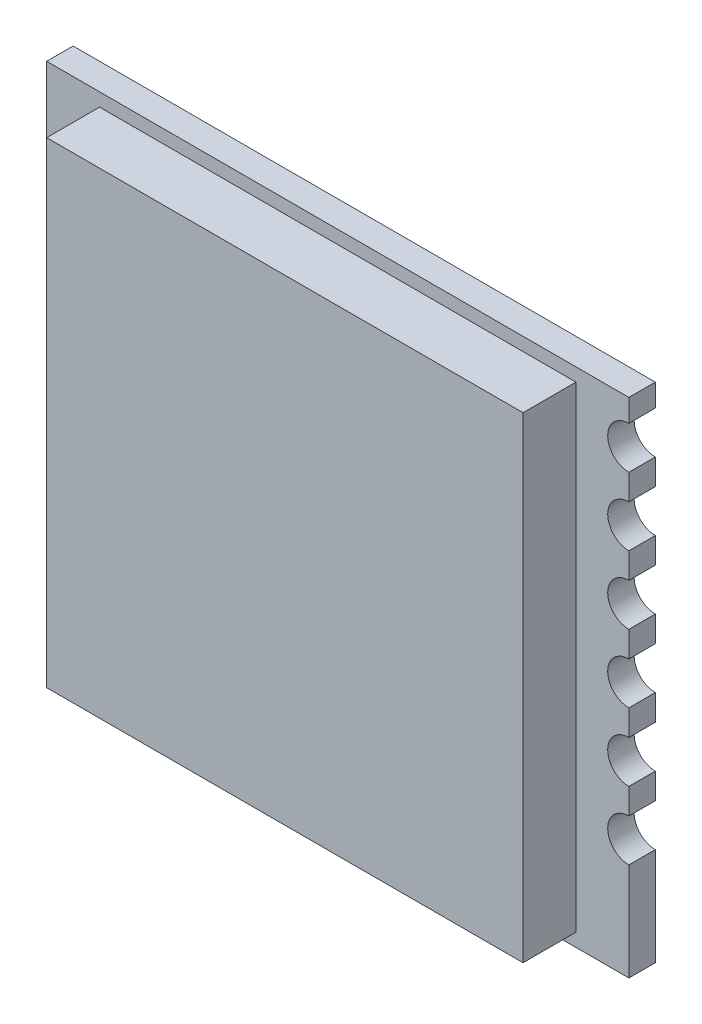
ISO-10303-21;
HEADER;
FILE_DESCRIPTION(('STEP AP214'),'2;1');
FILE_NAME('part.step','',(''),(''),'','','');
FILE_SCHEMA(('AUTOMOTIVE_DESIGN { 1 0 10303 214 1 1 1 1 }'));
ENDSEC;
DATA;
#1=APPLICATION_CONTEXT('core data for automotive mechanical design processes');
#2=APPLICATION_PROTOCOL_DEFINITION('international standard','automotive_design',2000,#1);
#3=PRODUCT_CONTEXT('',#1,'mechanical');
#4=PRODUCT('Part','Part','',(#3));
#5=PRODUCT_RELATED_PRODUCT_CATEGORY('part','',(#4));
#6=PRODUCT_DEFINITION_FORMATION('','',#4);
#7=PRODUCT_DEFINITION_CONTEXT('part definition',#1,'design');
#8=PRODUCT_DEFINITION('design','',#6,#7);
#9=PRODUCT_DEFINITION_SHAPE('','',#8);
#10=(LENGTH_UNIT() NAMED_UNIT(*) SI_UNIT(.MILLI.,.METRE.));
#11=(NAMED_UNIT(*) PLANE_ANGLE_UNIT() SI_UNIT($,.RADIAN.));
#12=(NAMED_UNIT(*) SI_UNIT($,.STERADIAN.) SOLID_ANGLE_UNIT());
#13=UNCERTAINTY_MEASURE_WITH_UNIT(LENGTH_MEASURE(1.E-05),#10,'distance_accuracy_value','');
#14=(GEOMETRIC_REPRESENTATION_CONTEXT(3) GLOBAL_UNCERTAINTY_ASSIGNED_CONTEXT((#13)) GLOBAL_UNIT_ASSIGNED_CONTEXT((#10,
#11,#12)) REPRESENTATION_CONTEXT('',''));
#15=CARTESIAN_POINT('',(0.,0.,0.));
#16=DIRECTION('',(0.,0.,1.));
#17=DIRECTION('',(1.,0.,0.));
#18=AXIS2_PLACEMENT_3D('',#15,#16,#17);
#19=CARTESIAN_POINT('',(-11.,-9.5,1.));
#20=DIRECTION('',(1.,0.,0.));
#21=DIRECTION('',(0.,1.,0.));
#22=AXIS2_PLACEMENT_3D('',#19,#20,#21);
#23=PLANE('',#22);
#24=DIRECTION('',(0.,-1.,0.));
#25=VECTOR('',#24,1.);
#26=CARTESIAN_POINT('',(-11.,-9.5,0.));
#27=LINE('',#26,#25);
#28=CARTESIAN_POINT('',(-11.,9.5,0.));
#29=VERTEX_POINT('',#28);
#30=CARTESIAN_POINT('',(-11.,6.08,0.));
#31=VERTEX_POINT('',#30);
#32=EDGE_CURVE('E403',#29,#31,#27,.T.);
#33=ORIENTED_EDGE('',*,*,#32,.T.);
#34=DIRECTION('',(0.,0.,1.));
#35=VECTOR('',#34,1.);
#36=CARTESIAN_POINT('',(-11.,6.08,0.));
#37=LINE('',#36,#35);
#38=CARTESIAN_POINT('',(-11.,6.08,1.));
#39=VERTEX_POINT('',#38);
#40=EDGE_CURVE('E554',#31,#39,#37,.T.);
#41=ORIENTED_EDGE('',*,*,#40,.T.);
#42=DIRECTION('',(0.,-1.,0.));
#43=VECTOR('',#42,1.);
#44=CARTESIAN_POINT('',(-11.,-9.5,1.));
#45=LINE('',#44,#43);
#46=CARTESIAN_POINT('',(-11.,9.5,1.));
#47=VERTEX_POINT('',#46);
#48=EDGE_CURVE('E394',#47,#39,#45,.T.);
#49=ORIENTED_EDGE('',*,*,#48,.F.);
#50=DIRECTION('',(0.,0.,-1.));
#51=VECTOR('',#50,1.);
#52=CARTESIAN_POINT('',(-11.,9.5,1.));
#53=LINE('',#52,#51);
#54=EDGE_CURVE('E270',#47,#29,#53,.T.);
#55=ORIENTED_EDGE('',*,*,#54,.T.);
#56=EDGE_LOOP('',(#33,#41,#49,#55));
#57=FACE_BOUND('',#56,.T.);
#58=ADVANCED_FACE('F38',(#57),#23,.F.);
#59=CARTESIAN_POINT('',(-11.,4.48,1.));
#60=VERTEX_POINT('',#59);
#61=CARTESIAN_POINT('',(-11.,3.51,1.));
#62=VERTEX_POINT('',#61);
#63=EDGE_CURVE('E398',#60,#62,#45,.T.);
#64=ORIENTED_EDGE('',*,*,#63,.F.);
#65=DIRECTION('',(0.,0.,1.));
#66=VECTOR('',#65,1.);
#67=CARTESIAN_POINT('',(-11.,4.48,0.));
#68=LINE('',#67,#66);
#69=CARTESIAN_POINT('',(-11.,4.48,0.));
#70=VERTEX_POINT('',#69);
#71=EDGE_CURVE('E327',#70,#60,#68,.T.);
#72=ORIENTED_EDGE('',*,*,#71,.F.);
#73=CARTESIAN_POINT('',(-11.,3.51,0.));
#74=VERTEX_POINT('',#73);
#75=EDGE_CURVE('E405',#70,#74,#27,.T.);
#76=ORIENTED_EDGE('',*,*,#75,.T.);
#77=DIRECTION('',(0.,0.,1.));
#78=VECTOR('',#77,1.);
#79=CARTESIAN_POINT('',(-11.,3.51,0.));
#80=LINE('',#79,#78);
#81=EDGE_CURVE('E326',#74,#62,#80,.T.);
#82=ORIENTED_EDGE('',*,*,#81,.T.);
#83=EDGE_LOOP('',(#64,#72,#76,#82));
#84=FACE_BOUND('',#83,.T.);
#85=ADVANCED_FACE('F460',(#84),#23,.F.);
#86=CARTESIAN_POINT('',(-11.,1.91,1.));
#87=VERTEX_POINT('',#86);
#88=CARTESIAN_POINT('',(-11.,0.939999999999998,1.));
#89=VERTEX_POINT('',#88);
#90=EDGE_CURVE('E440',#87,#89,#45,.T.);
#91=ORIENTED_EDGE('',*,*,#90,.F.);
#92=DIRECTION('',(0.,0.,1.));
#93=VECTOR('',#92,1.);
#94=CARTESIAN_POINT('',(-11.,1.91,0.));
#95=LINE('',#94,#93);
#96=CARTESIAN_POINT('',(-11.,1.91,0.));
#97=VERTEX_POINT('',#96);
#98=EDGE_CURVE('E319',#97,#87,#95,.T.);
#99=ORIENTED_EDGE('',*,*,#98,.F.);
#100=CARTESIAN_POINT('',(-11.,0.939999999999998,0.));
#101=VERTEX_POINT('',#100);
#102=EDGE_CURVE('E410',#97,#101,#27,.T.);
#103=ORIENTED_EDGE('',*,*,#102,.T.);
#104=DIRECTION('',(0.,0.,1.));
#105=VECTOR('',#104,1.);
#106=CARTESIAN_POINT('',(-11.,0.939999999999998,0.));
#107=LINE('',#106,#105);
#108=EDGE_CURVE('E318',#101,#89,#107,.T.);
#109=ORIENTED_EDGE('',*,*,#108,.T.);
#110=EDGE_LOOP('',(#91,#99,#103,#109));
#111=FACE_BOUND('',#110,.T.);
#112=ADVANCED_FACE('F429',(#111),#23,.F.);
#113=CARTESIAN_POINT('',(-11.,-0.660000000000003,1.));
#114=VERTEX_POINT('',#113);
#115=CARTESIAN_POINT('',(-11.,-1.63,1.));
#116=VERTEX_POINT('',#115);
#117=EDGE_CURVE('E437',#114,#116,#45,.T.);
#118=ORIENTED_EDGE('',*,*,#117,.F.);
#119=DIRECTION('',(0.,0.,1.));
#120=VECTOR('',#119,1.);
#121=CARTESIAN_POINT('',(-11.,-0.660000000000003,0.));
#122=LINE('',#121,#120);
#123=CARTESIAN_POINT('',(-11.,-0.660000000000003,0.));
#124=VERTEX_POINT('',#123);
#125=EDGE_CURVE('E311',#124,#114,#122,.T.);
#126=ORIENTED_EDGE('',*,*,#125,.F.);
#127=CARTESIAN_POINT('',(-11.,-1.63,0.));
#128=VERTEX_POINT('',#127);
#129=EDGE_CURVE('E416',#124,#128,#27,.T.);
#130=ORIENTED_EDGE('',*,*,#129,.T.);
#131=DIRECTION('',(0.,0.,1.));
#132=VECTOR('',#131,1.);
#133=CARTESIAN_POINT('',(-11.,-1.63,0.));
#134=LINE('',#133,#132);
#135=EDGE_CURVE('E301',#128,#116,#134,.T.);
#136=ORIENTED_EDGE('',*,*,#135,.T.);
#137=EDGE_LOOP('',(#118,#126,#130,#136));
#138=FACE_BOUND('',#137,.T.);
#139=ADVANCED_FACE('F435',(#138),#23,.F.);
#140=CARTESIAN_POINT('',(-11.,-3.23,1.));
#141=VERTEX_POINT('',#140);
#142=CARTESIAN_POINT('',(-11.,-4.2,1.));
#143=VERTEX_POINT('',#142);
#144=EDGE_CURVE('E441',#141,#143,#45,.T.);
#145=ORIENTED_EDGE('',*,*,#144,.F.);
#146=DIRECTION('',(0.,0.,1.));
#147=VECTOR('',#146,1.);
#148=CARTESIAN_POINT('',(-11.,-3.23,0.));
#149=LINE('',#148,#147);
#150=CARTESIAN_POINT('',(-11.,-3.23,0.));
#151=VERTEX_POINT('',#150);
#152=EDGE_CURVE('E297',#151,#141,#149,.T.);
#153=ORIENTED_EDGE('',*,*,#152,.F.);
#154=CARTESIAN_POINT('',(-11.,-4.2,0.));
#155=VERTEX_POINT('',#154);
#156=EDGE_CURVE('E411',#151,#155,#27,.T.);
#157=ORIENTED_EDGE('',*,*,#156,.T.);
#158=DIRECTION('',(0.,0.,1.));
#159=VECTOR('',#158,1.);
#160=CARTESIAN_POINT('',(-11.,-4.2,0.));
#161=LINE('',#160,#159);
#162=EDGE_CURVE('E333',#155,#143,#161,.T.);
#163=ORIENTED_EDGE('',*,*,#162,.T.);
#164=EDGE_LOOP('',(#145,#153,#157,#163));
#165=FACE_BOUND('',#164,.T.);
#166=ADVANCED_FACE('F451',(#165),#23,.F.);
#167=CARTESIAN_POINT('',(11.,-9.5,1.));
#168=DIRECTION('',(-1.,0.,0.));
#169=DIRECTION('',(0.,0.,1.));
#170=AXIS2_PLACEMENT_3D('',#167,#168,#169);
#171=PLANE('',#170);
#172=DIRECTION('',(0.,1.,0.));
#173=VECTOR('',#172,1.);
#174=CARTESIAN_POINT('',(11.,-9.5,0.));
#175=LINE('',#174,#173);
#176=CARTESIAN_POINT('',(11.,-4.2,0.));
#177=VERTEX_POINT('',#176);
#178=CARTESIAN_POINT('',(11.,-3.23,0.));
#179=VERTEX_POINT('',#178);
#180=EDGE_CURVE('E266',#177,#179,#175,.T.);
#181=ORIENTED_EDGE('',*,*,#180,.T.);
#182=DIRECTION('',(0.,0.,1.));
#183=VECTOR('',#182,1.);
#184=CARTESIAN_POINT('',(11.,-3.23,0.));
#185=LINE('',#184,#183);
#186=CARTESIAN_POINT('',(11.,-3.23,1.));
#187=VERTEX_POINT('',#186);
#188=EDGE_CURVE('E305',#179,#187,#185,.T.);
#189=ORIENTED_EDGE('',*,*,#188,.T.);
#190=DIRECTION('',(0.,1.,0.));
#191=VECTOR('',#190,1.);
#192=CARTESIAN_POINT('',(11.,-9.5,1.));
#193=LINE('',#192,#191);
#194=CARTESIAN_POINT('',(11.,-4.2,1.));
#195=VERTEX_POINT('',#194);
#196=EDGE_CURVE('E402',#195,#187,#193,.T.);
#197=ORIENTED_EDGE('',*,*,#196,.F.);
#198=DIRECTION('',(0.,0.,1.));
#199=VECTOR('',#198,1.);
#200=CARTESIAN_POINT('',(11.,-4.2,0.));
#201=LINE('',#200,#199);
#202=EDGE_CURVE('E299',#177,#195,#201,.T.);
#203=ORIENTED_EDGE('',*,*,#202,.F.);
#204=EDGE_LOOP('',(#181,#189,#197,#203));
#205=FACE_BOUND('',#204,.T.);
#206=ADVANCED_FACE('F462',(#205),#171,.F.);
#207=CARTESIAN_POINT('',(11.,-1.63,1.));
#208=VERTEX_POINT('',#207);
#209=CARTESIAN_POINT('',(11.,-0.660000000000003,1.));
#210=VERTEX_POINT('',#209);
#211=EDGE_CURVE('E534',#208,#210,#193,.T.);
#212=ORIENTED_EDGE('',*,*,#211,.F.);
#213=DIRECTION('',(0.,0.,1.));
#214=VECTOR('',#213,1.);
#215=CARTESIAN_POINT('',(11.,-1.63,0.));
#216=LINE('',#215,#214);
#217=CARTESIAN_POINT('',(11.,-1.63,0.));
#218=VERTEX_POINT('',#217);
#219=EDGE_CURVE('E545',#218,#208,#216,.T.);
#220=ORIENTED_EDGE('',*,*,#219,.F.);
#221=CARTESIAN_POINT('',(11.,-0.660000000000003,0.));
#222=VERTEX_POINT('',#221);
#223=EDGE_CURVE('E582',#218,#222,#175,.T.);
#224=ORIENTED_EDGE('',*,*,#223,.T.);
#225=DIRECTION('',(0.,0.,1.));
#226=VECTOR('',#225,1.);
#227=CARTESIAN_POINT('',(11.,-0.660000000000003,0.));
#228=LINE('',#227,#226);
#229=EDGE_CURVE('E551',#222,#210,#228,.T.);
#230=ORIENTED_EDGE('',*,*,#229,.T.);
#231=EDGE_LOOP('',(#212,#220,#224,#230));
#232=FACE_BOUND('',#231,.T.);
#233=ADVANCED_FACE('F467',(#232),#171,.F.);
#234=CARTESIAN_POINT('',(11.,0.939999999999998,1.));
#235=VERTEX_POINT('',#234);
#236=CARTESIAN_POINT('',(11.,1.91,1.));
#237=VERTEX_POINT('',#236);
#238=EDGE_CURVE('E530',#235,#237,#193,.T.);
#239=ORIENTED_EDGE('',*,*,#238,.F.);
#240=DIRECTION('',(0.,0.,1.));
#241=VECTOR('',#240,1.);
#242=CARTESIAN_POINT('',(11.,0.939999999999998,0.));
#243=LINE('',#242,#241);
#244=CARTESIAN_POINT('',(11.,0.939999999999998,0.));
#245=VERTEX_POINT('',#244);
#246=EDGE_CURVE('E548',#245,#235,#243,.T.);
#247=ORIENTED_EDGE('',*,*,#246,.F.);
#248=CARTESIAN_POINT('',(11.,1.91,0.));
#249=VERTEX_POINT('',#248);
#250=EDGE_CURVE('E259',#245,#249,#175,.T.);
#251=ORIENTED_EDGE('',*,*,#250,.T.);
#252=DIRECTION('',(0.,0.,1.));
#253=VECTOR('',#252,1.);
#254=CARTESIAN_POINT('',(11.,1.91,0.));
#255=LINE('',#254,#253);
#256=EDGE_CURVE('E559',#249,#237,#255,.T.);
#257=ORIENTED_EDGE('',*,*,#256,.T.);
#258=EDGE_LOOP('',(#239,#247,#251,#257));
#259=FACE_BOUND('',#258,.T.);
#260=ADVANCED_FACE('F581',(#259),#171,.F.);
#261=CARTESIAN_POINT('',(11.,-9.5,0.));
#262=VERTEX_POINT('',#261);
#263=CARTESIAN_POINT('',(11.,-5.8,0.));
#264=VERTEX_POINT('',#263);
#265=EDGE_CURVE('E261',#262,#264,#175,.T.);
#266=ORIENTED_EDGE('',*,*,#265,.T.);
#267=DIRECTION('',(0.,0.,1.));
#268=VECTOR('',#267,1.);
#269=CARTESIAN_POINT('',(11.,-5.8,0.));
#270=LINE('',#269,#268);
#271=CARTESIAN_POINT('',(11.,-5.8,1.));
#272=VERTEX_POINT('',#271);
#273=EDGE_CURVE('E296',#264,#272,#270,.T.);
#274=ORIENTED_EDGE('',*,*,#273,.T.);
#275=CARTESIAN_POINT('',(11.,-9.5,1.));
#276=VERTEX_POINT('',#275);
#277=EDGE_CURVE('E284',#276,#272,#193,.T.);
#278=ORIENTED_EDGE('',*,*,#277,.F.);
#279=DIRECTION('',(0.,0.,-1.));
#280=VECTOR('',#279,1.);
#281=CARTESIAN_POINT('',(11.,-9.5,1.));
#282=LINE('',#281,#280);
#283=EDGE_CURVE('E46',#276,#262,#282,.T.);
#284=ORIENTED_EDGE('',*,*,#283,.T.);
#285=EDGE_LOOP('',(#266,#274,#278,#284));
#286=FACE_BOUND('',#285,.T.);
#287=ADVANCED_FACE('F281',(#286),#171,.F.);
#288=CARTESIAN_POINT('',(11.,3.51,1.));
#289=VERTEX_POINT('',#288);
#290=CARTESIAN_POINT('',(11.,4.48,1.));
#291=VERTEX_POINT('',#290);
#292=EDGE_CURVE('E528',#289,#291,#193,.T.);
#293=ORIENTED_EDGE('',*,*,#292,.F.);
#294=DIRECTION('',(0.,0.,1.));
#295=VECTOR('',#294,1.);
#296=CARTESIAN_POINT('',(11.,3.51,0.));
#297=LINE('',#296,#295);
#298=CARTESIAN_POINT('',(11.,3.51,0.));
#299=VERTEX_POINT('',#298);
#300=EDGE_CURVE('E562',#299,#289,#297,.T.);
#301=ORIENTED_EDGE('',*,*,#300,.F.);
#302=CARTESIAN_POINT('',(11.,4.48,0.));
#303=VERTEX_POINT('',#302);
#304=EDGE_CURVE('E256',#299,#303,#175,.T.);
#305=ORIENTED_EDGE('',*,*,#304,.T.);
#306=DIRECTION('',(0.,0.,1.));
#307=VECTOR('',#306,1.);
#308=CARTESIAN_POINT('',(11.,4.48,0.));
#309=LINE('',#308,#307);
#310=EDGE_CURVE('E61',#303,#291,#309,.T.);
#311=ORIENTED_EDGE('',*,*,#310,.T.);
#312=EDGE_LOOP('',(#293,#301,#305,#311));
#313=FACE_BOUND('',#312,.T.);
#314=ADVANCED_FACE('F457',(#313),#171,.F.);
#315=CARTESIAN_POINT('',(11.,6.08,1.));
#316=VERTEX_POINT('',#315);
#317=CARTESIAN_POINT('',(11.,7.05,1.));
#318=VERTEX_POINT('',#317);
#319=EDGE_CURVE('E249',#316,#318,#193,.T.);
#320=ORIENTED_EDGE('',*,*,#319,.F.);
#321=DIRECTION('',(0.,0.,1.));
#322=VECTOR('',#321,1.);
#323=CARTESIAN_POINT('',(11.,6.08,0.));
#324=LINE('',#323,#322);
#325=CARTESIAN_POINT('',(11.,6.08,0.));
#326=VERTEX_POINT('',#325);
#327=EDGE_CURVE('E235',#326,#316,#324,.T.);
#328=ORIENTED_EDGE('',*,*,#327,.F.);
#329=CARTESIAN_POINT('',(11.,7.05,0.));
#330=VERTEX_POINT('',#329);
#331=EDGE_CURVE('E247',#326,#330,#175,.T.);
#332=ORIENTED_EDGE('',*,*,#331,.T.);
#333=DIRECTION('',(0.,0.,1.));
#334=VECTOR('',#333,1.);
#335=CARTESIAN_POINT('',(11.,7.05,0.));
#336=LINE('',#335,#334);
#337=EDGE_CURVE('E53',#330,#318,#336,.T.);
#338=ORIENTED_EDGE('',*,*,#337,.T.);
#339=EDGE_LOOP('',(#320,#328,#332,#338));
#340=FACE_BOUND('',#339,.T.);
#341=ADVANCED_FACE('F246',(#340),#171,.F.);
#342=CARTESIAN_POINT('',(-11.,-5.8,1.));
#343=VERTEX_POINT('',#342);
#344=CARTESIAN_POINT('',(-11.,-9.5,1.));
#345=VERTEX_POINT('',#344);
#346=EDGE_CURVE('E269',#343,#345,#45,.T.);
#347=ORIENTED_EDGE('',*,*,#346,.F.);
#348=DIRECTION('',(0.,0.,1.));
#349=VECTOR('',#348,1.);
#350=CARTESIAN_POINT('',(-11.,-5.8,0.));
#351=LINE('',#350,#349);
#352=CARTESIAN_POINT('',(-11.,-5.8,0.));
#353=VERTEX_POINT('',#352);
#354=EDGE_CURVE('E334',#353,#343,#351,.T.);
#355=ORIENTED_EDGE('',*,*,#354,.F.);
#356=CARTESIAN_POINT('',(-11.,-9.5,0.));
#357=VERTEX_POINT('',#356);
#358=EDGE_CURVE('E393',#353,#357,#27,.T.);
#359=ORIENTED_EDGE('',*,*,#358,.T.);
#360=DIRECTION('',(0.,0.,-1.));
#361=VECTOR('',#360,1.);
#362=CARTESIAN_POINT('',(-11.,-9.5,1.));
#363=LINE('',#362,#361);
#364=EDGE_CURVE('E11',#345,#357,#363,.T.);
#365=ORIENTED_EDGE('',*,*,#364,.F.);
#366=EDGE_LOOP('',(#347,#355,#359,#365));
#367=FACE_BOUND('',#366,.T.);
#368=ADVANCED_FACE('F40',(#367),#23,.F.);
#369=CARTESIAN_POINT('',(11.,-9.5,1.));
#370=DIRECTION('',(0.,1.,0.));
#371=DIRECTION('',(0.,0.,1.));
#372=AXIS2_PLACEMENT_3D('',#369,#370,#371);
#373=PLANE('',#372);
#374=DIRECTION('',(1.,0.,0.));
#375=VECTOR('',#374,1.);
#376=CARTESIAN_POINT('',(11.,-9.5,0.));
#377=LINE('',#376,#375);
#378=EDGE_CURVE('E260',#357,#262,#377,.T.);
#379=ORIENTED_EDGE('',*,*,#378,.T.);
#380=ORIENTED_EDGE('',*,*,#283,.F.);
#381=DIRECTION('',(1.,0.,0.));
#382=VECTOR('',#381,1.);
#383=CARTESIAN_POINT('',(11.,-9.5,1.));
#384=LINE('',#383,#382);
#385=EDGE_CURVE('E397',#345,#276,#384,.T.);
#386=ORIENTED_EDGE('',*,*,#385,.F.);
#387=ORIENTED_EDGE('',*,*,#364,.T.);
#388=EDGE_LOOP('',(#379,#380,#386,#387));
#389=FACE_BOUND('',#388,.T.);
#390=ADVANCED_FACE('F449',(#389),#373,.F.);
#391=CARTESIAN_POINT('',(11.,8.65,1.));
#392=VERTEX_POINT('',#391);
#393=CARTESIAN_POINT('',(11.,9.5,1.));
#394=VERTEX_POINT('',#393);
#395=EDGE_CURVE('E400',#392,#394,#193,.T.);
#396=ORIENTED_EDGE('',*,*,#395,.F.);
#397=DIRECTION('',(0.,0.,1.));
#398=VECTOR('',#397,1.);
#399=CARTESIAN_POINT('',(11.,8.65,0.));
#400=LINE('',#399,#398);
#401=CARTESIAN_POINT('',(11.,8.65,0.));
#402=VERTEX_POINT('',#401);
#403=EDGE_CURVE('E241',#402,#392,#400,.T.);
#404=ORIENTED_EDGE('',*,*,#403,.F.);
#405=CARTESIAN_POINT('',(11.,9.5,0.));
#406=VERTEX_POINT('',#405);
#407=EDGE_CURVE('E257',#402,#406,#175,.T.);
#408=ORIENTED_EDGE('',*,*,#407,.T.);
#409=DIRECTION('',(0.,0.,-1.));
#410=VECTOR('',#409,1.);
#411=CARTESIAN_POINT('',(11.,9.5,1.));
#412=LINE('',#411,#410);
#413=EDGE_CURVE('E273',#394,#406,#412,.T.);
#414=ORIENTED_EDGE('',*,*,#413,.F.);
#415=EDGE_LOOP('',(#396,#404,#408,#414));
#416=FACE_BOUND('',#415,.T.);
#417=ADVANCED_FACE('F456',(#416),#171,.F.);
#418=CARTESIAN_POINT('',(11.,9.5,1.));
#419=DIRECTION('',(0.,-1.,0.));
#420=DIRECTION('',(1.,0.,0.));
#421=AXIS2_PLACEMENT_3D('',#418,#419,#420);
#422=PLANE('',#421);
#423=DIRECTION('',(-1.,0.,0.));
#424=VECTOR('',#423,1.);
#425=CARTESIAN_POINT('',(11.,9.5,0.));
#426=LINE('',#425,#424);
#427=EDGE_CURVE('E265',#406,#29,#426,.T.);
#428=ORIENTED_EDGE('',*,*,#427,.T.);
#429=ORIENTED_EDGE('',*,*,#54,.F.);
#430=DIRECTION('',(-1.,0.,0.));
#431=VECTOR('',#430,1.);
#432=CARTESIAN_POINT('',(11.,9.5,1.));
#433=LINE('',#432,#431);
#434=EDGE_CURVE('E274',#394,#47,#433,.T.);
#435=ORIENTED_EDGE('',*,*,#434,.F.);
#436=ORIENTED_EDGE('',*,*,#413,.T.);
#437=EDGE_LOOP('',(#428,#429,#435,#436));
#438=FACE_BOUND('',#437,.T.);
#439=ADVANCED_FACE('F514',(#438),#422,.F.);
#440=CARTESIAN_POINT('',(0.,0.,1.));
#441=DIRECTION('',(0.,0.,1.));
#442=DIRECTION('',(1.,0.,0.));
#443=AXIS2_PLACEMENT_3D('',#440,#441,#442);
#444=PLANE('',#443);
#445=CARTESIAN_POINT('',(-11.,5.28,1.));
#446=DIRECTION('',(0.,0.,1.));
#447=DIRECTION('',(1.,0.,0.));
#448=AXIS2_PLACEMENT_3D('',#445,#446,#447);
#449=CIRCLE('',#448,0.8);
#450=EDGE_CURVE('E358',#60,#39,#449,.T.);
#451=ORIENTED_EDGE('',*,*,#450,.F.);
#452=ORIENTED_EDGE('',*,*,#63,.T.);
#453=CARTESIAN_POINT('',(-11.,2.71,1.));
#454=DIRECTION('',(0.,0.,1.));
#455=DIRECTION('',(1.,0.,0.));
#456=AXIS2_PLACEMENT_3D('',#453,#454,#455);
#457=CIRCLE('',#456,0.8);
#458=EDGE_CURVE('E350',#87,#62,#457,.T.);
#459=ORIENTED_EDGE('',*,*,#458,.F.);
#460=ORIENTED_EDGE('',*,*,#90,.T.);
#461=CARTESIAN_POINT('',(-11.,0.139999999999998,1.));
#462=DIRECTION('',(0.,0.,1.));
#463=DIRECTION('',(1.,0.,0.));
#464=AXIS2_PLACEMENT_3D('',#461,#462,#463);
#465=CIRCLE('',#464,0.8);
#466=EDGE_CURVE('E348',#114,#89,#465,.T.);
#467=ORIENTED_EDGE('',*,*,#466,.F.);
#468=ORIENTED_EDGE('',*,*,#117,.T.);
#469=CARTESIAN_POINT('',(-11.,-2.43,1.));
#470=DIRECTION('',(0.,0.,1.));
#471=DIRECTION('',(1.,0.,0.));
#472=AXIS2_PLACEMENT_3D('',#469,#470,#471);
#473=CIRCLE('',#472,0.8);
#474=EDGE_CURVE('E346',#141,#116,#473,.T.);
#475=ORIENTED_EDGE('',*,*,#474,.F.);
#476=ORIENTED_EDGE('',*,*,#144,.T.);
#477=CARTESIAN_POINT('',(-11.,-5.,1.));
#478=DIRECTION('',(0.,0.,1.));
#479=DIRECTION('',(1.,0.,0.));
#480=AXIS2_PLACEMENT_3D('',#477,#478,#479);
#481=CIRCLE('',#480,0.8);
#482=EDGE_CURVE('E336',#343,#143,#481,.T.);
#483=ORIENTED_EDGE('',*,*,#482,.F.);
#484=ORIENTED_EDGE('',*,*,#346,.T.);
#485=ORIENTED_EDGE('',*,*,#385,.T.);
#486=ORIENTED_EDGE('',*,*,#277,.T.);
#487=CARTESIAN_POINT('',(11.,-5.,1.));
#488=DIRECTION('',(0.,0.,1.));
#489=DIRECTION('',(1.,0.,0.));
#490=AXIS2_PLACEMENT_3D('',#487,#488,#489);
#491=CIRCLE('',#490,0.8);
#492=EDGE_CURVE('E344',#195,#272,#491,.T.);
#493=ORIENTED_EDGE('',*,*,#492,.F.);
#494=ORIENTED_EDGE('',*,*,#196,.T.);
#495=CARTESIAN_POINT('',(11.,-2.43,1.));
#496=DIRECTION('',(0.,0.,1.));
#497=DIRECTION('',(1.,0.,0.));
#498=AXIS2_PLACEMENT_3D('',#495,#496,#497);
#499=CIRCLE('',#498,0.8);
#500=EDGE_CURVE('E356',#208,#187,#499,.T.);
#501=ORIENTED_EDGE('',*,*,#500,.F.);
#502=ORIENTED_EDGE('',*,*,#211,.T.);
#503=CARTESIAN_POINT('',(11.,0.139999999999998,1.));
#504=DIRECTION('',(0.,0.,1.));
#505=DIRECTION('',(1.,0.,0.));
#506=AXIS2_PLACEMENT_3D('',#503,#504,#505);
#507=CIRCLE('',#506,0.8);
#508=EDGE_CURVE('E354',#235,#210,#507,.T.);
#509=ORIENTED_EDGE('',*,*,#508,.F.);
#510=ORIENTED_EDGE('',*,*,#238,.T.);
#511=CARTESIAN_POINT('',(11.,2.71,1.));
#512=DIRECTION('',(0.,0.,1.));
#513=DIRECTION('',(1.,0.,0.));
#514=AXIS2_PLACEMENT_3D('',#511,#512,#513);
#515=CIRCLE('',#514,0.8);
#516=EDGE_CURVE('E352',#289,#237,#515,.T.);
#517=ORIENTED_EDGE('',*,*,#516,.F.);
#518=ORIENTED_EDGE('',*,*,#292,.T.);
#519=CARTESIAN_POINT('',(11.,5.28,1.));
#520=DIRECTION('',(0.,0.,1.));
#521=DIRECTION('',(1.,0.,0.));
#522=AXIS2_PLACEMENT_3D('',#519,#520,#521);
#523=CIRCLE('',#522,0.8);
#524=EDGE_CURVE('E342',#316,#291,#523,.T.);
#525=ORIENTED_EDGE('',*,*,#524,.F.);
#526=ORIENTED_EDGE('',*,*,#319,.T.);
#527=CARTESIAN_POINT('',(11.,7.85,1.));
#528=DIRECTION('',(0.,0.,1.));
#529=DIRECTION('',(1.,0.,0.));
#530=AXIS2_PLACEMENT_3D('',#527,#528,#529);
#531=CIRCLE('',#530,0.8);
#532=EDGE_CURVE('E340',#392,#318,#531,.T.);
#533=ORIENTED_EDGE('',*,*,#532,.F.);
#534=ORIENTED_EDGE('',*,*,#395,.T.);
#535=ORIENTED_EDGE('',*,*,#434,.T.);
#536=ORIENTED_EDGE('',*,*,#48,.T.);
#537=EDGE_LOOP('',(#451,#452,#459,#460,#467,#468,#475,#476,#483,#484,#485,#486,#493,#494,#501,
#502,#509,#510,#517,#518,#525,#526,#533,#534,#535,#536));
#538=FACE_BOUND('',#537,.T.);
#539=DIRECTION('',(0.,-1.,0.));
#540=VECTOR('',#539,1.);
#541=CARTESIAN_POINT('',(-8.99999999999999,-9.,1.));
#542=LINE('',#541,#540);
#543=CARTESIAN_POINT('',(-8.99999999999999,9.,1.));
#544=VERTEX_POINT('',#543);
#545=CARTESIAN_POINT('',(-8.99999999999999,-9.,1.));
#546=VERTEX_POINT('',#545);
#547=EDGE_CURVE('E360',#544,#546,#542,.T.);
#548=ORIENTED_EDGE('',*,*,#547,.F.);
#549=DIRECTION('',(-1.,0.,0.));
#550=VECTOR('',#549,1.);
#551=CARTESIAN_POINT('',(9.00000000000001,9.,1.));
#552=LINE('',#551,#550);
#553=CARTESIAN_POINT('',(9.00000000000001,9.,1.));
#554=VERTEX_POINT('',#553);
#555=EDGE_CURVE('E365',#554,#544,#552,.T.);
#556=ORIENTED_EDGE('',*,*,#555,.F.);
#557=DIRECTION('',(0.,1.,0.));
#558=VECTOR('',#557,1.);
#559=CARTESIAN_POINT('',(9.00000000000001,-9.,1.));
#560=LINE('',#559,#558);
#561=CARTESIAN_POINT('',(9.00000000000001,-9.,1.));
#562=VERTEX_POINT('',#561);
#563=EDGE_CURVE('E377',#562,#554,#560,.T.);
#564=ORIENTED_EDGE('',*,*,#563,.F.);
#565=DIRECTION('',(1.,0.,0.));
#566=VECTOR('',#565,1.);
#567=CARTESIAN_POINT('',(9.00000000000001,-9.,1.));
#568=LINE('',#567,#566);
#569=EDGE_CURVE('E374',#546,#562,#568,.T.);
#570=ORIENTED_EDGE('',*,*,#569,.F.);
#571=EDGE_LOOP('',(#548,#556,#564,#570));
#572=FACE_BOUND('',#571,.T.);
#573=ADVANCED_FACE('F447',(#538,#572),#444,.T.);
#574=CARTESIAN_POINT('',(0.,0.,0.));
#575=DIRECTION('',(0.,0.,1.));
#576=DIRECTION('',(1.,0.,0.));
#577=AXIS2_PLACEMENT_3D('',#574,#575,#576);
#578=PLANE('',#577);
#579=ORIENTED_EDGE('',*,*,#75,.F.);
#580=CARTESIAN_POINT('',(-11.,5.28,0.));
#581=DIRECTION('',(0.,0.,1.));
#582=DIRECTION('',(1.,0.,0.));
#583=AXIS2_PLACEMENT_3D('',#580,#581,#582);
#584=CIRCLE('',#583,0.8);
#585=EDGE_CURVE('E547',#70,#31,#584,.T.);
#586=ORIENTED_EDGE('',*,*,#585,.T.);
#587=ORIENTED_EDGE('',*,*,#32,.F.);
#588=ORIENTED_EDGE('',*,*,#427,.F.);
#589=ORIENTED_EDGE('',*,*,#407,.F.);
#590=CARTESIAN_POINT('',(11.,7.85,0.));
#591=DIRECTION('',(0.,0.,1.));
#592=DIRECTION('',(-1.,0.,0.));
#593=AXIS2_PLACEMENT_3D('',#590,#591,#592);
#594=CIRCLE('',#593,0.8);
#595=EDGE_CURVE('E255',#402,#330,#594,.T.);
#596=ORIENTED_EDGE('',*,*,#595,.T.);
#597=ORIENTED_EDGE('',*,*,#331,.F.);
#598=CARTESIAN_POINT('',(11.,5.28,0.));
#599=DIRECTION('',(0.,0.,1.));
#600=DIRECTION('',(-1.,0.,0.));
#601=AXIS2_PLACEMENT_3D('',#598,#599,#600);
#602=CIRCLE('',#601,0.8);
#603=EDGE_CURVE('E232',#326,#303,#602,.T.);
#604=ORIENTED_EDGE('',*,*,#603,.T.);
#605=ORIENTED_EDGE('',*,*,#304,.F.);
#606=CARTESIAN_POINT('',(11.,2.71,0.));
#607=DIRECTION('',(0.,0.,1.));
#608=DIRECTION('',(-1.,0.,0.));
#609=AXIS2_PLACEMENT_3D('',#606,#607,#608);
#610=CIRCLE('',#609,0.8);
#611=EDGE_CURVE('E250',#299,#249,#610,.T.);
#612=ORIENTED_EDGE('',*,*,#611,.T.);
#613=ORIENTED_EDGE('',*,*,#250,.F.);
#614=CARTESIAN_POINT('',(11.,0.139999999999998,0.));
#615=DIRECTION('',(0.,0.,1.));
#616=DIRECTION('',(-1.,0.,0.));
#617=AXIS2_PLACEMENT_3D('',#614,#615,#616);
#618=CIRCLE('',#617,0.8);
#619=EDGE_CURVE('E564',#245,#222,#618,.T.);
#620=ORIENTED_EDGE('',*,*,#619,.T.);
#621=ORIENTED_EDGE('',*,*,#223,.F.);
#622=CARTESIAN_POINT('',(11.,-2.43,0.));
#623=DIRECTION('',(0.,0.,1.));
#624=DIRECTION('',(-1.,0.,0.));
#625=AXIS2_PLACEMENT_3D('',#622,#623,#624);
#626=CIRCLE('',#625,0.8);
#627=EDGE_CURVE('E546',#218,#179,#626,.T.);
#628=ORIENTED_EDGE('',*,*,#627,.T.);
#629=ORIENTED_EDGE('',*,*,#180,.F.);
#630=CARTESIAN_POINT('',(11.,-5.,0.));
#631=DIRECTION('',(0.,0.,1.));
#632=DIRECTION('',(-1.,0.,0.));
#633=AXIS2_PLACEMENT_3D('',#630,#631,#632);
#634=CIRCLE('',#633,0.8);
#635=EDGE_CURVE('E291',#177,#264,#634,.T.);
#636=ORIENTED_EDGE('',*,*,#635,.T.);
#637=ORIENTED_EDGE('',*,*,#265,.F.);
#638=ORIENTED_EDGE('',*,*,#378,.F.);
#639=ORIENTED_EDGE('',*,*,#358,.F.);
#640=CARTESIAN_POINT('',(-11.,-5.,0.));
#641=DIRECTION('',(0.,0.,1.));
#642=DIRECTION('',(1.,0.,0.));
#643=AXIS2_PLACEMENT_3D('',#640,#641,#642);
#644=CIRCLE('',#643,0.8);
#645=EDGE_CURVE('E307',#353,#155,#644,.T.);
#646=ORIENTED_EDGE('',*,*,#645,.T.);
#647=ORIENTED_EDGE('',*,*,#156,.F.);
#648=CARTESIAN_POINT('',(-11.,-2.43,0.));
#649=DIRECTION('',(0.,0.,1.));
#650=DIRECTION('',(1.,0.,0.));
#651=AXIS2_PLACEMENT_3D('',#648,#649,#650);
#652=CIRCLE('',#651,0.8);
#653=EDGE_CURVE('E309',#151,#128,#652,.T.);
#654=ORIENTED_EDGE('',*,*,#653,.T.);
#655=ORIENTED_EDGE('',*,*,#129,.F.);
#656=CARTESIAN_POINT('',(-11.,0.139999999999998,0.));
#657=DIRECTION('',(0.,0.,1.));
#658=DIRECTION('',(1.,0.,0.));
#659=AXIS2_PLACEMENT_3D('',#656,#657,#658);
#660=CIRCLE('',#659,0.8);
#661=EDGE_CURVE('E315',#124,#101,#660,.T.);
#662=ORIENTED_EDGE('',*,*,#661,.T.);
#663=ORIENTED_EDGE('',*,*,#102,.F.);
#664=CARTESIAN_POINT('',(-11.,2.71,0.));
#665=DIRECTION('',(0.,0.,1.));
#666=DIRECTION('',(1.,0.,0.));
#667=AXIS2_PLACEMENT_3D('',#664,#665,#666);
#668=CIRCLE('',#667,0.8);
#669=EDGE_CURVE('E323',#97,#74,#668,.T.);
#670=ORIENTED_EDGE('',*,*,#669,.T.);
#671=EDGE_LOOP('',(#579,#586,#587,#588,#589,#596,#597,#604,#605,#612,#613,#620,#621,#628,#629,
#636,#637,#638,#639,#646,#647,#654,#655,#662,#663,#670));
#672=FACE_BOUND('',#671,.T.);
#673=ADVANCED_FACE('F253',(#672),#578,.F.);
#674=CARTESIAN_POINT('',(-8.99999999999999,-9.,3.));
#675=DIRECTION('',(1.,0.,0.));
#676=DIRECTION('',(0.,0.,-1.));
#677=AXIS2_PLACEMENT_3D('',#674,#675,#676);
#678=PLANE('',#677);
#679=ORIENTED_EDGE('',*,*,#547,.T.);
#680=DIRECTION('',(0.,0.,-1.));
#681=VECTOR('',#680,1.);
#682=CARTESIAN_POINT('',(-8.99999999999999,-9.,3.));
#683=LINE('',#682,#681);
#684=CARTESIAN_POINT('',(-8.99999999999999,-9.,3.));
#685=VERTEX_POINT('',#684);
#686=EDGE_CURVE('E390',#685,#546,#683,.T.);
#687=ORIENTED_EDGE('',*,*,#686,.F.);
#688=DIRECTION('',(0.,-1.,0.));
#689=VECTOR('',#688,1.);
#690=CARTESIAN_POINT('',(-8.99999999999999,-9.,3.));
#691=LINE('',#690,#689);
#692=CARTESIAN_POINT('',(-8.99999999999999,9.,3.));
#693=VERTEX_POINT('',#692);
#694=EDGE_CURVE('E361',#693,#685,#691,.T.);
#695=ORIENTED_EDGE('',*,*,#694,.F.);
#696=DIRECTION('',(0.,0.,-1.));
#697=VECTOR('',#696,1.);
#698=CARTESIAN_POINT('',(-8.99999999999999,9.,3.));
#699=LINE('',#698,#697);
#700=EDGE_CURVE('E371',#693,#544,#699,.T.);
#701=ORIENTED_EDGE('',*,*,#700,.T.);
#702=EDGE_LOOP('',(#679,#687,#695,#701));
#703=FACE_BOUND('',#702,.T.);
#704=ADVANCED_FACE('F507',(#703),#678,.F.);
#705=CARTESIAN_POINT('',(9.00000000000001,-9.,3.));
#706=DIRECTION('',(0.,1.,0.));
#707=DIRECTION('',(-1.,0.,0.));
#708=AXIS2_PLACEMENT_3D('',#705,#706,#707);
#709=PLANE('',#708);
#710=ORIENTED_EDGE('',*,*,#569,.T.);
#711=DIRECTION('',(0.,0.,-1.));
#712=VECTOR('',#711,1.);
#713=CARTESIAN_POINT('',(9.00000000000001,-9.,3.));
#714=LINE('',#713,#712);
#715=CARTESIAN_POINT('',(9.00000000000001,-9.,3.));
#716=VERTEX_POINT('',#715);
#717=EDGE_CURVE('E387',#716,#562,#714,.T.);
#718=ORIENTED_EDGE('',*,*,#717,.F.);
#719=DIRECTION('',(1.,0.,0.));
#720=VECTOR('',#719,1.);
#721=CARTESIAN_POINT('',(9.00000000000001,-9.,3.));
#722=LINE('',#721,#720);
#723=EDGE_CURVE('E364',#685,#716,#722,.T.);
#724=ORIENTED_EDGE('',*,*,#723,.F.);
#725=ORIENTED_EDGE('',*,*,#686,.T.);
#726=EDGE_LOOP('',(#710,#718,#724,#725));
#727=FACE_BOUND('',#726,.T.);
#728=ADVANCED_FACE('F503',(#727),#709,.F.);
#729=CARTESIAN_POINT('',(9.00000000000001,-9.,3.));
#730=DIRECTION('',(-1.,0.,0.));
#731=DIRECTION('',(0.,0.,1.));
#732=AXIS2_PLACEMENT_3D('',#729,#730,#731);
#733=PLANE('',#732);
#734=ORIENTED_EDGE('',*,*,#563,.T.);
#735=DIRECTION('',(0.,0.,-1.));
#736=VECTOR('',#735,1.);
#737=CARTESIAN_POINT('',(9.00000000000001,9.,3.));
#738=LINE('',#737,#736);
#739=CARTESIAN_POINT('',(9.00000000000001,9.,3.));
#740=VERTEX_POINT('',#739);
#741=EDGE_CURVE('E384',#740,#554,#738,.T.);
#742=ORIENTED_EDGE('',*,*,#741,.F.);
#743=DIRECTION('',(0.,1.,0.));
#744=VECTOR('',#743,1.);
#745=CARTESIAN_POINT('',(9.00000000000001,-9.,3.));
#746=LINE('',#745,#744);
#747=EDGE_CURVE('E367',#716,#740,#746,.T.);
#748=ORIENTED_EDGE('',*,*,#747,.F.);
#749=ORIENTED_EDGE('',*,*,#717,.T.);
#750=EDGE_LOOP('',(#734,#742,#748,#749));
#751=FACE_BOUND('',#750,.T.);
#752=ADVANCED_FACE('F499',(#751),#733,.F.);
#753=CARTESIAN_POINT('',(9.00000000000001,9.,3.));
#754=DIRECTION('',(0.,-1.,0.));
#755=DIRECTION('',(1.,0.,0.));
#756=AXIS2_PLACEMENT_3D('',#753,#754,#755);
#757=PLANE('',#756);
#758=ORIENTED_EDGE('',*,*,#555,.T.);
#759=ORIENTED_EDGE('',*,*,#700,.F.);
#760=DIRECTION('',(-1.,0.,0.));
#761=VECTOR('',#760,1.);
#762=CARTESIAN_POINT('',(9.00000000000001,9.,3.));
#763=LINE('',#762,#761);
#764=EDGE_CURVE('E369',#740,#693,#763,.T.);
#765=ORIENTED_EDGE('',*,*,#764,.F.);
#766=ORIENTED_EDGE('',*,*,#741,.T.);
#767=EDGE_LOOP('',(#758,#759,#765,#766));
#768=FACE_BOUND('',#767,.T.);
#769=ADVANCED_FACE('F495',(#768),#757,.F.);
#770=CARTESIAN_POINT('',(0.,0.,3.));
#771=DIRECTION('',(0.,0.,1.));
#772=DIRECTION('',(1.,0.,0.));
#773=AXIS2_PLACEMENT_3D('',#770,#771,#772);
#774=PLANE('',#773);
#775=ORIENTED_EDGE('',*,*,#694,.T.);
#776=ORIENTED_EDGE('',*,*,#723,.T.);
#777=ORIENTED_EDGE('',*,*,#747,.T.);
#778=ORIENTED_EDGE('',*,*,#764,.T.);
#779=EDGE_LOOP('',(#775,#776,#777,#778));
#780=FACE_BOUND('',#779,.T.);
#781=ADVANCED_FACE('F492',(#780),#774,.T.);
#782=CARTESIAN_POINT('',(-11.,-5.,0.));
#783=DIRECTION('',(0.,0.,1.));
#784=DIRECTION('',(1.,0.,0.));
#785=AXIS2_PLACEMENT_3D('',#782,#783,#784);
#786=CYLINDRICAL_SURFACE('',#785,0.8);
#787=ORIENTED_EDGE('',*,*,#482,.T.);
#788=ORIENTED_EDGE('',*,*,#162,.F.);
#789=ORIENTED_EDGE('',*,*,#645,.F.);
#790=ORIENTED_EDGE('',*,*,#354,.T.);
#791=EDGE_LOOP('',(#787,#788,#789,#790));
#792=FACE_BOUND('',#791,.T.);
#793=ADVANCED_FACE('F470',(#792),#786,.F.);
#794=CARTESIAN_POINT('',(11.,7.85,0.));
#795=DIRECTION('',(0.,0.,1.));
#796=DIRECTION('',(1.,0.,0.));
#797=AXIS2_PLACEMENT_3D('',#794,#795,#796);
#798=CYLINDRICAL_SURFACE('',#797,0.8);
#799=ORIENTED_EDGE('',*,*,#532,.T.);
#800=ORIENTED_EDGE('',*,*,#337,.F.);
#801=ORIENTED_EDGE('',*,*,#595,.F.);
#802=ORIENTED_EDGE('',*,*,#403,.T.);
#803=EDGE_LOOP('',(#799,#800,#801,#802));
#804=FACE_BOUND('',#803,.T.);
#805=ADVANCED_FACE('F491',(#804),#798,.F.);
#806=CARTESIAN_POINT('',(11.,5.28,0.));
#807=DIRECTION('',(0.,0.,1.));
#808=DIRECTION('',(1.,0.,0.));
#809=AXIS2_PLACEMENT_3D('',#806,#807,#808);
#810=CYLINDRICAL_SURFACE('',#809,0.8);
#811=ORIENTED_EDGE('',*,*,#524,.T.);
#812=ORIENTED_EDGE('',*,*,#310,.F.);
#813=ORIENTED_EDGE('',*,*,#603,.F.);
#814=ORIENTED_EDGE('',*,*,#327,.T.);
#815=EDGE_LOOP('',(#811,#812,#813,#814));
#816=FACE_BOUND('',#815,.T.);
#817=ADVANCED_FACE('F234',(#816),#810,.F.);
#818=CARTESIAN_POINT('',(11.,-5.,0.));
#819=DIRECTION('',(0.,0.,1.));
#820=DIRECTION('',(1.,0.,0.));
#821=AXIS2_PLACEMENT_3D('',#818,#819,#820);
#822=CYLINDRICAL_SURFACE('',#821,0.8);
#823=ORIENTED_EDGE('',*,*,#492,.T.);
#824=ORIENTED_EDGE('',*,*,#273,.F.);
#825=ORIENTED_EDGE('',*,*,#635,.F.);
#826=ORIENTED_EDGE('',*,*,#202,.T.);
#827=EDGE_LOOP('',(#823,#824,#825,#826));
#828=FACE_BOUND('',#827,.T.);
#829=ADVANCED_FACE('F474',(#828),#822,.F.);
#830=CARTESIAN_POINT('',(-11.,-2.43,0.));
#831=DIRECTION('',(0.,0.,1.));
#832=DIRECTION('',(1.,0.,0.));
#833=AXIS2_PLACEMENT_3D('',#830,#831,#832);
#834=CYLINDRICAL_SURFACE('',#833,0.8);
#835=ORIENTED_EDGE('',*,*,#474,.T.);
#836=ORIENTED_EDGE('',*,*,#135,.F.);
#837=ORIENTED_EDGE('',*,*,#653,.F.);
#838=ORIENTED_EDGE('',*,*,#152,.T.);
#839=EDGE_LOOP('',(#835,#836,#837,#838));
#840=FACE_BOUND('',#839,.T.);
#841=ADVANCED_FACE('F472',(#840),#834,.F.);
#842=CARTESIAN_POINT('',(-11.,0.139999999999998,0.));
#843=DIRECTION('',(0.,0.,1.));
#844=DIRECTION('',(1.,0.,0.));
#845=AXIS2_PLACEMENT_3D('',#842,#843,#844);
#846=CYLINDRICAL_SURFACE('',#845,0.8);
#847=ORIENTED_EDGE('',*,*,#466,.T.);
#848=ORIENTED_EDGE('',*,*,#108,.F.);
#849=ORIENTED_EDGE('',*,*,#661,.F.);
#850=ORIENTED_EDGE('',*,*,#125,.T.);
#851=EDGE_LOOP('',(#847,#848,#849,#850));
#852=FACE_BOUND('',#851,.T.);
#853=ADVANCED_FACE('F432',(#852),#846,.F.);
#854=CARTESIAN_POINT('',(-11.,2.71,0.));
#855=DIRECTION('',(0.,0.,1.));
#856=DIRECTION('',(1.,0.,0.));
#857=AXIS2_PLACEMENT_3D('',#854,#855,#856);
#858=CYLINDRICAL_SURFACE('',#857,0.8);
#859=ORIENTED_EDGE('',*,*,#458,.T.);
#860=ORIENTED_EDGE('',*,*,#81,.F.);
#861=ORIENTED_EDGE('',*,*,#669,.F.);
#862=ORIENTED_EDGE('',*,*,#98,.T.);
#863=EDGE_LOOP('',(#859,#860,#861,#862));
#864=FACE_BOUND('',#863,.T.);
#865=ADVANCED_FACE('F480',(#864),#858,.F.);
#866=CARTESIAN_POINT('',(11.,2.71,0.));
#867=DIRECTION('',(0.,0.,1.));
#868=DIRECTION('',(1.,0.,0.));
#869=AXIS2_PLACEMENT_3D('',#866,#867,#868);
#870=CYLINDRICAL_SURFACE('',#869,0.8);
#871=ORIENTED_EDGE('',*,*,#516,.T.);
#872=ORIENTED_EDGE('',*,*,#256,.F.);
#873=ORIENTED_EDGE('',*,*,#611,.F.);
#874=ORIENTED_EDGE('',*,*,#300,.T.);
#875=EDGE_LOOP('',(#871,#872,#873,#874));
#876=FACE_BOUND('',#875,.T.);
#877=ADVANCED_FACE('F487',(#876),#870,.F.);
#878=CARTESIAN_POINT('',(11.,0.139999999999998,0.));
#879=DIRECTION('',(0.,0.,1.));
#880=DIRECTION('',(1.,0.,0.));
#881=AXIS2_PLACEMENT_3D('',#878,#879,#880);
#882=CYLINDRICAL_SURFACE('',#881,0.8);
#883=ORIENTED_EDGE('',*,*,#508,.T.);
#884=ORIENTED_EDGE('',*,*,#229,.F.);
#885=ORIENTED_EDGE('',*,*,#619,.F.);
#886=ORIENTED_EDGE('',*,*,#246,.T.);
#887=EDGE_LOOP('',(#883,#884,#885,#886));
#888=FACE_BOUND('',#887,.T.);
#889=ADVANCED_FACE('F587',(#888),#882,.F.);
#890=CARTESIAN_POINT('',(11.,-2.43,0.));
#891=DIRECTION('',(0.,0.,1.));
#892=DIRECTION('',(1.,0.,0.));
#893=AXIS2_PLACEMENT_3D('',#890,#891,#892);
#894=CYLINDRICAL_SURFACE('',#893,0.8);
#895=ORIENTED_EDGE('',*,*,#500,.T.);
#896=ORIENTED_EDGE('',*,*,#188,.F.);
#897=ORIENTED_EDGE('',*,*,#627,.F.);
#898=ORIENTED_EDGE('',*,*,#219,.T.);
#899=EDGE_LOOP('',(#895,#896,#897,#898));
#900=FACE_BOUND('',#899,.T.);
#901=ADVANCED_FACE('F589',(#900),#894,.F.);
#902=CARTESIAN_POINT('',(-11.,5.28,0.));
#903=DIRECTION('',(0.,0.,1.));
#904=DIRECTION('',(1.,0.,0.));
#905=AXIS2_PLACEMENT_3D('',#902,#903,#904);
#906=CYLINDRICAL_SURFACE('',#905,0.8);
#907=ORIENTED_EDGE('',*,*,#450,.T.);
#908=ORIENTED_EDGE('',*,*,#40,.F.);
#909=ORIENTED_EDGE('',*,*,#585,.F.);
#910=ORIENTED_EDGE('',*,*,#71,.T.);
#911=EDGE_LOOP('',(#907,#908,#909,#910));
#912=FACE_BOUND('',#911,.T.);
#913=ADVANCED_FACE('F595',(#912),#906,.F.);
#914=CLOSED_SHELL('',(#58,#85,#112,#139,#166,#206,#233,#260,#287,#314,#341,#368,#390,#417,#439,
#573,#673,#704,#728,#752,#769,#781,#793,#805,#817,#829,#841,#853,#865,#877,#889,#901,#913));
#915=MANIFOLD_SOLID_BREP('B2',#914);
#916=ADVANCED_BREP_SHAPE_REPRESENTATION('',(#18,#915),#14);
#917=SHAPE_DEFINITION_REPRESENTATION(#9,#916);
ENDSEC;
END-ISO-10303-21;
